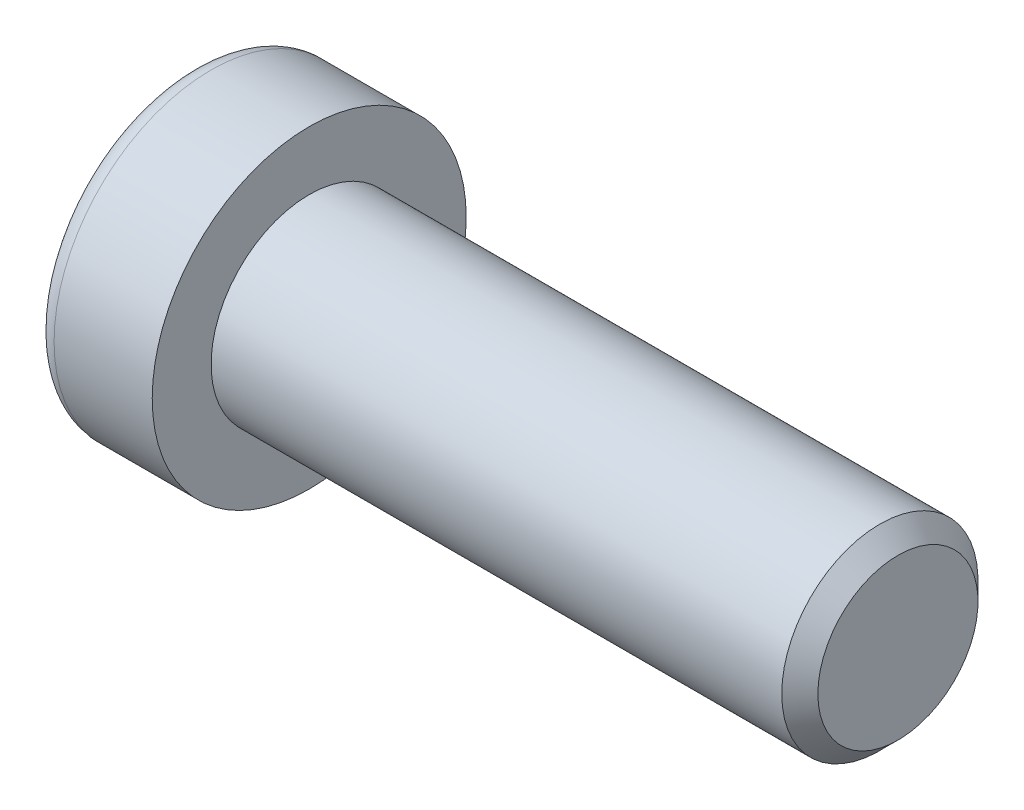
ISO-10303-21;
HEADER;
FILE_DESCRIPTION(('STEP AP214'),'2;1');
FILE_NAME('part.step','',(''),(''),'','','');
FILE_SCHEMA(('AUTOMOTIVE_DESIGN { 1 0 10303 214 1 1 1 1 }'));
ENDSEC;
DATA;
#1=APPLICATION_CONTEXT('core data for automotive mechanical design processes');
#2=APPLICATION_PROTOCOL_DEFINITION('international standard','automotive_design',2000,#1);
#3=PRODUCT_CONTEXT('',#1,'mechanical');
#4=PRODUCT('Part','Part','',(#3));
#5=PRODUCT_RELATED_PRODUCT_CATEGORY('part','',(#4));
#6=PRODUCT_DEFINITION_FORMATION('','',#4);
#7=PRODUCT_DEFINITION_CONTEXT('part definition',#1,'design');
#8=PRODUCT_DEFINITION('design','',#6,#7);
#9=PRODUCT_DEFINITION_SHAPE('','',#8);
#10=(LENGTH_UNIT() NAMED_UNIT(*) SI_UNIT(.MILLI.,.METRE.));
#11=(NAMED_UNIT(*) PLANE_ANGLE_UNIT() SI_UNIT($,.RADIAN.));
#12=(NAMED_UNIT(*) SI_UNIT($,.STERADIAN.) SOLID_ANGLE_UNIT());
#13=UNCERTAINTY_MEASURE_WITH_UNIT(LENGTH_MEASURE(1.E-05),#10,'distance_accuracy_value','');
#14=(GEOMETRIC_REPRESENTATION_CONTEXT(3) GLOBAL_UNCERTAINTY_ASSIGNED_CONTEXT((#13)) GLOBAL_UNIT_ASSIGNED_CONTEXT((#10,
#11,#12)) REPRESENTATION_CONTEXT('',''));
#15=CARTESIAN_POINT('',(0.,0.,0.));
#16=DIRECTION('',(0.,0.,1.));
#17=DIRECTION('',(1.,0.,0.));
#18=AXIS2_PLACEMENT_3D('',#15,#16,#17);
#19=CARTESIAN_POINT('',(-1.51400000237345,0.,0.));
#20=DIRECTION('',(-1.,0.,0.));
#21=DIRECTION('',(0.,0.,1.));
#22=AXIS2_PLACEMENT_3D('',#19,#20,#21);
#23=CONICAL_SURFACE('',#22,4.06570059402611,1.04719754992225);
#24=CARTESIAN_POINT('',(0.833333336629494,-1.70530256582424E-10,0.));
#25=VERTEX_POINT('',#24);
#26=VERTEX_LOOP('',#25);
#27=FACE_BOUND('',#26,.T.);
#28=CARTESIAN_POINT('',(-1.50000000264528,3.50000000060251,2.02072594140006));
#29=CARTESIAN_POINT('',(-1.44871720671821,3.5000000002164,1.84312860694103));
#30=CARTESIAN_POINT('',(-1.40207818764734,3.500000000058,1.66399825484513));
#31=CARTESIAN_POINT('',(-1.3206711805367,3.49999999994187,1.30263602844114));
#32=CARTESIAN_POINT('',(-1.28593198806702,3.49999999998461,1.12039773551564));
#33=CARTESIAN_POINT('',(-1.23185793049781,3.50000000001501,0.758179537473421));
#34=CARTESIAN_POINT('',(-1.21216313061087,3.500000000004,0.578255348658129));
#35=CARTESIAN_POINT('',(-1.18865604653685,3.49999999999601,0.217560809963439));
#36=CARTESIAN_POINT('',(-1.18482429178125,3.499999999999,0.0367917702110673));
#37=CARTESIAN_POINT('',(-1.19281601017606,3.50000000000088,-0.300955787963849));
#38=CARTESIAN_POINT('',(-1.20267725157549,3.50000000000024,-0.457984988160007));
#39=CARTESIAN_POINT('',(-1.23392527879677,3.49999999999977,-0.771020394529853));
#40=CARTESIAN_POINT('',(-1.25532272843638,3.49999999999994,-0.927025518805758));
#41=CARTESIAN_POINT('',(-1.30881221104621,3.50000000000007,-1.24070580763249));
#42=CARTESIAN_POINT('',(-1.34113087664882,3.50000000000004,-1.39834129173674));
#43=CARTESIAN_POINT('',(-1.41448058436693,3.49999999999997,-1.71126180669209));
#44=CARTESIAN_POINT('',(-1.45549440328289,3.49999999999993,-1.86655084332427));
#45=CARTESIAN_POINT('',(-1.50000000303707,3.5,-2.02072594139078));
#46=B_SPLINE_CURVE_WITH_KNOTS('',3,(#28,#29,#30,#31,#32,#33,#34,#35,#36,#37,#38,#39,#40,#41,#42,
#43,#44,#45),.UNSPECIFIED.,.F.,.F.,(4,2,2,2,2,2,2,2,4),(0.,0.554778020331152,1.11088918003109,
1.65323831106675,2.19492155592635,2.66648861952189,3.13849233862163,3.62096283842857,
4.10248645230881),.UNSPECIFIED.);
#47=CARTESIAN_POINT('',(-1.5000000030094,3.49999999962383,2.0207259419465));
#48=VERTEX_POINT('',#47);
#49=CARTESIAN_POINT('',(-1.50000000313479,3.5,-2.02072594172932));
#50=VERTEX_POINT('',#49);
#51=EDGE_CURVE('E20',#48,#50,#46,.T.);
#52=ORIENTED_EDGE('',*,*,#51,.T.);
#53=CARTESIAN_POINT('',(-1.50000000264528,3.49999999963993,-2.0207259430673));
#54=CARTESIAN_POINT('',(-1.44871720671821,3.34619619616096,-2.10952460996242));
#55=CARTESIAN_POINT('',(-1.40207818764734,3.19106476057786,-2.1990897858732));
#56=CARTESIAN_POINT('',(-1.3206711805367,2.87811589248583,-2.37977089897462));
#57=CARTESIAN_POINT('',(-1.28593198806702,2.72029290129141,-2.47089004547439));
#58=CARTESIAN_POINT('',(-1.2318579304978,2.40660274008903,-2.65199914452182));
#59=CARTESIAN_POINT('',(-1.21216313061087,2.25078382181417,-2.74196123891994));
#60=CARTESIAN_POINT('',(-1.18865604653685,1.93841318829426,-2.92230850826035));
#61=CARTESIAN_POINT('',(-1.18482429178125,1.78186260765249,-3.01269302813913));
#62=CARTESIAN_POINT('',(-1.19281601017606,1.48936464220778,-3.18156680722821));
#63=CARTESIAN_POINT('',(-1.20267725157549,1.35337336570164,-3.26008140732574));
#64=CARTESIAN_POINT('',(-1.23392527879676,1.08227675150113,-3.41659911051026));
#65=CARTESIAN_POINT('',(-1.25532272843638,0.947172350757734,-3.49460167264836));
#66=CARTESIAN_POINT('',(-1.30881221104621,0.675517251967411,-3.65144181706184));
#67=CARTESIAN_POINT('',(-1.34113087664882,0.539000918195258,-3.73025955911393));
#68=CARTESIAN_POINT('',(-1.41448058436693,0.26800380287858,-3.88671981659155));
#69=CARTESIAN_POINT('',(-1.45549440328289,0.133519552225884,-3.96436433490761));
#70=CARTESIAN_POINT('',(-1.50000000303707,6.69361529194486E-10,-4.04145188394093));
#71=B_SPLINE_CURVE_WITH_KNOTS('',3,(#53,#54,#55,#56,#57,#58,#59,#60,#61,#62,#63,#64,#65,#66,#67,
#68,#69,#70),.UNSPECIFIED.,.F.,.F.,(4,2,2,2,2,2,2,2,4),(0.,0.554778020331152,1.11088918003109,
1.65323831106675,2.19492155592635,2.66648861952189,3.13849233862163,3.62096283842857,
4.10248645230881),.UNSPECIFIED.);
#72=CARTESIAN_POINT('',(-1.5000000030094,0.,-4.04145188389301));
#73=VERTEX_POINT('',#72);
#74=EDGE_CURVE('E81',#50,#73,#71,.T.);
#75=ORIENTED_EDGE('',*,*,#74,.T.);
#76=CARTESIAN_POINT('',(-1.50000000264528,-9.62577057104049E-10,-4.04145188446735));
#77=CARTESIAN_POINT('',(-1.44871720671821,-0.153803804055437,-3.95265321690346));
#78=CARTESIAN_POINT('',(-1.40207818764734,-0.308935239480137,-3.86308804071833));
#79=CARTESIAN_POINT('',(-1.3206711805367,-0.621884107456032,-3.68240692741576));
#80=CARTESIAN_POINT('',(-1.28593198806702,-0.779707098693197,-3.59128778099003));
#81=CARTESIAN_POINT('',(-1.2318579304978,-1.09339725992598,-3.41017868199525));
#82=CARTESIAN_POINT('',(-1.21216313061087,-1.24921617818983,-3.32021658757807));
#83=CARTESIAN_POINT('',(-1.18865604653685,-1.56158681170174,-3.1398693182238));
#84=CARTESIAN_POINT('',(-1.18482429178125,-1.71813739234651,-3.0494847983502));
#85=CARTESIAN_POINT('',(-1.19281601017606,-2.01063535779309,-2.88061101926437));
#86=CARTESIAN_POINT('',(-1.20267725157549,-2.1466266342986,-2.80209641916574));
#87=CARTESIAN_POINT('',(-1.23392527879676,-2.41772324849863,-2.64557871598041));
#88=CARTESIAN_POINT('',(-1.25532272843638,-2.5528276492422,-2.5675761538426));
#89=CARTESIAN_POINT('',(-1.30881221104621,-2.82448274803266,-2.41073600942935));
#90=CARTESIAN_POINT('',(-1.34113087664882,-2.96099908180478,-2.3319182673772));
#91=CARTESIAN_POINT('',(-1.41448058436693,-3.23199619712139,-2.17545800989946));
#92=CARTESIAN_POINT('',(-1.45549440328289,-3.36648044777405,-2.09781349158334));
#93=CARTESIAN_POINT('',(-1.50000000303707,-3.49999999933064,-2.02072594255015));
#94=B_SPLINE_CURVE_WITH_KNOTS('',3,(#76,#77,#78,#79,#80,#81,#82,#83,#84,#85,#86,#87,#88,#89,#90,
#91,#92,#93),.UNSPECIFIED.,.F.,.F.,(4,2,2,2,2,2,2,2,4),(0.,0.554778020331152,1.11088918003109,
1.65323831106675,2.19492155592635,2.66648861952189,3.13849233862163,3.62096283842857,
4.10248645230881),.UNSPECIFIED.);
#95=CARTESIAN_POINT('',(-1.5000000030094,-3.49999999962383,-2.0207259419465));
#96=VERTEX_POINT('',#95);
#97=EDGE_CURVE('E107',#73,#96,#94,.T.);
#98=ORIENTED_EDGE('',*,*,#97,.T.);
#99=CARTESIAN_POINT('',(-1.50000000264528,-3.50000000060251,-2.02072594140006));
#100=CARTESIAN_POINT('',(-1.44871720671821,-3.50000000021639,-1.84312860694103));
#101=CARTESIAN_POINT('',(-1.40207818764734,-3.500000000058,-1.66399825484514));
#102=CARTESIAN_POINT('',(-1.3206711805367,-3.49999999994186,-1.30263602844114));
#103=CARTESIAN_POINT('',(-1.28593198806702,-3.49999999998461,-1.12039773551565));
#104=CARTESIAN_POINT('',(-1.2318579304978,-3.50000000001501,-0.758179537473426));
#105=CARTESIAN_POINT('',(-1.21216313061087,-3.500000000004,-0.578255348658134));
#106=CARTESIAN_POINT('',(-1.18865604653685,-3.499999999996,-0.217560809963444));
#107=CARTESIAN_POINT('',(-1.18482429178125,-3.499999999999,-0.0367917702110726));
#108=CARTESIAN_POINT('',(-1.19281601017606,-3.50000000000087,0.300955787963844));
#109=CARTESIAN_POINT('',(-1.20267725157549,-3.50000000000024,0.457984988160002));
#110=CARTESIAN_POINT('',(-1.23392527879676,-3.49999999999977,0.771020394529848));
#111=CARTESIAN_POINT('',(-1.25532272843637,-3.49999999999993,0.927025518805754));
#112=CARTESIAN_POINT('',(-1.30881221104621,-3.50000000000007,1.24070580763249));
#113=CARTESIAN_POINT('',(-1.34113087664882,-3.50000000000004,1.39834129173673));
#114=CARTESIAN_POINT('',(-1.41448058436693,-3.49999999999997,1.71126180669209));
#115=CARTESIAN_POINT('',(-1.45549440328289,-3.49999999999993,1.86655084332426));
#116=CARTESIAN_POINT('',(-1.50000000303706,-3.5,2.02072594139078));
#117=B_SPLINE_CURVE_WITH_KNOTS('',3,(#99,#100,#101,#102,#103,#104,#105,#106,#107,#108,#109,#110,
#111,#112,#113,#114,#115,#116),.UNSPECIFIED.,.F.,.F.,(4,2,2,2,2,2,2,2,4),(0.,0.554778020331152,
1.11088918003109,1.65323831106675,2.19492155592635,2.66648861952189,3.13849233862163,
3.62096283842857,4.10248645230881),.UNSPECIFIED.);
#118=CARTESIAN_POINT('',(-1.5000000030094,-3.49999999962383,2.0207259419465));
#119=VERTEX_POINT('',#118);
#120=EDGE_CURVE('E132',#96,#119,#117,.T.);
#121=ORIENTED_EDGE('',*,*,#120,.T.);
#122=CARTESIAN_POINT('',(-1.50000000264528,-3.49999999963993,2.02072594306729));
#123=CARTESIAN_POINT('',(-1.44871720671821,-3.34619619616096,2.10952460996242));
#124=CARTESIAN_POINT('',(-1.40207818764735,-3.19106476057786,2.19908978587319));
#125=CARTESIAN_POINT('',(-1.3206711805367,-2.87811589248583,2.37977089897461));
#126=CARTESIAN_POINT('',(-1.28593198806702,-2.72029290129141,2.47089004547438));
#127=CARTESIAN_POINT('',(-1.2318579304978,-2.40660274008903,2.65199914452182));
#128=CARTESIAN_POINT('',(-1.21216313061087,-2.25078382181417,2.74196123891993));
#129=CARTESIAN_POINT('',(-1.18865604653685,-1.93841318829426,2.92230850826035));
#130=CARTESIAN_POINT('',(-1.18482429178125,-1.78186260765249,3.01269302813913));
#131=CARTESIAN_POINT('',(-1.19281601017606,-1.48936464220779,3.18156680722821));
#132=CARTESIAN_POINT('',(-1.20267725157549,-1.35337336570164,3.26008140732574));
#133=CARTESIAN_POINT('',(-1.23392527879676,-1.08227675150113,3.41659911051026));
#134=CARTESIAN_POINT('',(-1.25532272843637,-0.947172350757735,3.49460167264835));
#135=CARTESIAN_POINT('',(-1.30881221104621,-0.675517251967412,3.65144181706184));
#136=CARTESIAN_POINT('',(-1.34113087664882,-0.539000918195259,3.73025955911393));
#137=CARTESIAN_POINT('',(-1.41448058436693,-0.268003802878581,3.88671981659155));
#138=CARTESIAN_POINT('',(-1.45549440328289,-0.133519552225885,3.96436433490761));
#139=CARTESIAN_POINT('',(-1.50000000303706,-6.693623426515E-10,4.04145188394092));
#140=B_SPLINE_CURVE_WITH_KNOTS('',3,(#122,#123,#124,#125,#126,#127,#128,#129,#130,#131,#132,
#133,#134,#135,#136,#137,#138,#139),.UNSPECIFIED.,.F.,.F.,(4,2,2,2,2,2,2,2,4),(0.,
0.554778020331152,1.11088918003109,1.65323831106675,2.19492155592635,2.66648861952189,
3.13849233862163,3.62096283842857,4.10248645230881),.UNSPECIFIED.);
#141=CARTESIAN_POINT('',(-1.5000000030094,0.,4.04145188389301));
#142=VERTEX_POINT('',#141);
#143=EDGE_CURVE('E141',#119,#142,#140,.T.);
#144=ORIENTED_EDGE('',*,*,#143,.T.);
#145=CARTESIAN_POINT('',(-1.50000000264528,9.62576994072292E-10,4.04145188446735));
#146=CARTESIAN_POINT('',(-1.44871720671821,0.153803804055437,3.95265321690346));
#147=CARTESIAN_POINT('',(-1.40207818764734,0.308935239480137,3.86308804071833));
#148=CARTESIAN_POINT('',(-1.3206711805367,0.621884107456031,3.68240692741576));
#149=CARTESIAN_POINT('',(-1.28593198806702,0.779707098693196,3.59128778099003));
#150=CARTESIAN_POINT('',(-1.2318579304978,1.09339725992598,3.41017868199525));
#151=CARTESIAN_POINT('',(-1.21216313061087,1.24921617818983,3.32021658757807));
#152=CARTESIAN_POINT('',(-1.18865604653685,1.56158681170174,3.1398693182238));
#153=CARTESIAN_POINT('',(-1.18482429178125,1.71813739234651,3.0494847983502));
#154=CARTESIAN_POINT('',(-1.19281601017606,2.01063535779309,2.88061101926437));
#155=CARTESIAN_POINT('',(-1.20267725157549,2.14662663429859,2.80209641916574));
#156=CARTESIAN_POINT('',(-1.23392527879676,2.41772324849863,2.6455787159804));
#157=CARTESIAN_POINT('',(-1.25532272843637,2.5528276492422,2.5675761538426));
#158=CARTESIAN_POINT('',(-1.30881221104621,2.82448274803266,2.41073600942935));
#159=CARTESIAN_POINT('',(-1.34113087664881,2.96099908180478,2.33191826737719));
#160=CARTESIAN_POINT('',(-1.41448058436693,3.23199619712139,2.17545800989946));
#161=CARTESIAN_POINT('',(-1.45549440328289,3.36648044777405,2.09781349158334));
#162=CARTESIAN_POINT('',(-1.50000000303706,3.49999999933064,2.02072594255014));
#163=B_SPLINE_CURVE_WITH_KNOTS('',3,(#145,#146,#147,#148,#149,#150,#151,#152,#153,#154,#155,
#156,#157,#158,#159,#160,#161,#162),.UNSPECIFIED.,.F.,.F.,(4,2,2,2,2,2,2,2,4),(0.,
0.554778020331152,1.11088918003109,1.65323831106675,2.19492155592635,2.66648861952189,
3.13849233862163,3.62096283842857,4.10248645230882),.UNSPECIFIED.);
#164=EDGE_CURVE('E83',#142,#48,#163,.T.);
#165=ORIENTED_EDGE('',*,*,#164,.T.);
#166=EDGE_LOOP('',(#52,#75,#98,#121,#144,#165));
#167=FACE_BOUND('',#166,.T.);
#168=ADVANCED_FACE('F16',(#27,#167),#23,.F.);
#169=CARTESIAN_POINT('',(-6.,3.5,2.02072594216369));
#170=DIRECTION('',(0.,1.,0.));
#171=DIRECTION('',(0.,0.,1.));
#172=AXIS2_PLACEMENT_3D('',#169,#170,#171);
#173=PLANE('',#172);
#174=DIRECTION('',(1.,0.,0.));
#175=VECTOR('',#174,1.);
#176=CARTESIAN_POINT('',(-6.,3.5,2.02072594216368));
#177=LINE('',#176,#175);
#178=CARTESIAN_POINT('',(-6.,3.5,2.02072594216369));
#179=VERTEX_POINT('',#178);
#180=EDGE_CURVE('E85',#48,#179,#177,.F.);
#181=ORIENTED_EDGE('',*,*,#180,.T.);
#182=DIRECTION('',(0.,0.,1.));
#183=VECTOR('',#182,1.);
#184=CARTESIAN_POINT('',(-6.,3.5,0.));
#185=LINE('',#184,#183);
#186=CARTESIAN_POINT('',(-6.,3.5,-2.02072594216369));
#187=VERTEX_POINT('',#186);
#188=EDGE_CURVE('E90',#187,#179,#185,.T.);
#189=ORIENTED_EDGE('',*,*,#188,.F.);
#190=DIRECTION('',(1.,0.,0.));
#191=VECTOR('',#190,1.);
#192=CARTESIAN_POINT('',(-6.,3.5,-2.02072594216369));
#193=LINE('',#192,#191);
#194=EDGE_CURVE('E88',#187,#50,#193,.T.);
#195=ORIENTED_EDGE('',*,*,#194,.T.);
#196=ORIENTED_EDGE('',*,*,#51,.F.);
#197=EDGE_LOOP('',(#181,#189,#195,#196));
#198=FACE_BOUND('',#197,.T.);
#199=ADVANCED_FACE('F77',(#198),#173,.F.);
#200=CARTESIAN_POINT('',(-6.,0.,4.04145188432738));
#201=DIRECTION('',(0.,0.500000000000001,0.866025403784438));
#202=DIRECTION('',(0.,-0.866025403784438,0.500000000000001));
#203=AXIS2_PLACEMENT_3D('',#200,#201,#202);
#204=PLANE('',#203);
#205=DIRECTION('',(1.,0.,0.));
#206=VECTOR('',#205,1.);
#207=CARTESIAN_POINT('',(-6.,0.,4.04145188432738));
#208=LINE('',#207,#206);
#209=CARTESIAN_POINT('',(-6.,0.,4.04145188432738));
#210=VERTEX_POINT('',#209);
#211=EDGE_CURVE('E146',#142,#210,#208,.F.);
#212=ORIENTED_EDGE('',*,*,#211,.T.);
#213=DIRECTION('',(0.,-0.866025403784438,0.500000000000001));
#214=VECTOR('',#213,1.);
#215=CARTESIAN_POINT('',(-6.,3.5,2.02072594216369));
#216=LINE('',#215,#214);
#217=EDGE_CURVE('E96',#179,#210,#216,.T.);
#218=ORIENTED_EDGE('',*,*,#217,.F.);
#219=ORIENTED_EDGE('',*,*,#180,.F.);
#220=ORIENTED_EDGE('',*,*,#164,.F.);
#221=EDGE_LOOP('',(#212,#218,#219,#220));
#222=FACE_BOUND('',#221,.T.);
#223=ADVANCED_FACE('F151',(#222),#204,.F.);
#224=CARTESIAN_POINT('',(-6.,-3.5,2.02072594216369));
#225=DIRECTION('',(0.,-0.5,0.866025403784439));
#226=DIRECTION('',(0.,-0.866025403784439,-0.5));
#227=AXIS2_PLACEMENT_3D('',#224,#225,#226);
#228=PLANE('',#227);
#229=DIRECTION('',(1.,0.,0.));
#230=VECTOR('',#229,1.);
#231=CARTESIAN_POINT('',(-6.,-3.5,2.02072594216369));
#232=LINE('',#231,#230);
#233=CARTESIAN_POINT('',(-6.,-3.5,2.02072594216369));
#234=VERTEX_POINT('',#233);
#235=EDGE_CURVE('E140',#119,#234,#232,.F.);
#236=ORIENTED_EDGE('',*,*,#235,.T.);
#237=DIRECTION('',(0.,-0.866025403784439,-0.5));
#238=VECTOR('',#237,1.);
#239=CARTESIAN_POINT('',(-6.,0.,4.04145188432738));
#240=LINE('',#239,#238);
#241=EDGE_CURVE('E229',#210,#234,#240,.T.);
#242=ORIENTED_EDGE('',*,*,#241,.F.);
#243=ORIENTED_EDGE('',*,*,#211,.F.);
#244=ORIENTED_EDGE('',*,*,#143,.F.);
#245=EDGE_LOOP('',(#236,#242,#243,#244));
#246=FACE_BOUND('',#245,.T.);
#247=ADVANCED_FACE('F128',(#246),#228,.F.);
#248=CARTESIAN_POINT('',(-6.,-3.5,-2.02072594216369));
#249=DIRECTION('',(0.,-1.,0.));
#250=DIRECTION('',(0.,0.,-1.));
#251=AXIS2_PLACEMENT_3D('',#248,#249,#250);
#252=PLANE('',#251);
#253=DIRECTION('',(1.,0.,0.));
#254=VECTOR('',#253,1.);
#255=CARTESIAN_POINT('',(-6.,-3.5,-2.02072594216369));
#256=LINE('',#255,#254);
#257=CARTESIAN_POINT('',(-6.,-3.5,-2.02072594216369));
#258=VERTEX_POINT('',#257);
#259=EDGE_CURVE('E139',#96,#258,#256,.F.);
#260=ORIENTED_EDGE('',*,*,#259,.T.);
#261=DIRECTION('',(0.,0.,1.));
#262=VECTOR('',#261,1.);
#263=CARTESIAN_POINT('',(-6.,-3.5,0.));
#264=LINE('',#263,#262);
#265=EDGE_CURVE('E226',#234,#258,#264,.F.);
#266=ORIENTED_EDGE('',*,*,#265,.F.);
#267=ORIENTED_EDGE('',*,*,#235,.F.);
#268=ORIENTED_EDGE('',*,*,#120,.F.);
#269=EDGE_LOOP('',(#260,#266,#267,#268));
#270=FACE_BOUND('',#269,.T.);
#271=ADVANCED_FACE('F124',(#270),#252,.F.);
#272=CARTESIAN_POINT('',(-6.,0.,-4.04145188432738));
#273=DIRECTION('',(0.,-0.5,-0.866025403784439));
#274=DIRECTION('',(0.,0.866025403784439,-0.5));
#275=AXIS2_PLACEMENT_3D('',#272,#273,#274);
#276=PLANE('',#275);
#277=DIRECTION('',(1.,0.,0.));
#278=VECTOR('',#277,1.);
#279=CARTESIAN_POINT('',(-6.,0.,-4.04145188432738));
#280=LINE('',#279,#278);
#281=CARTESIAN_POINT('',(-6.,0.,-4.04145188432738));
#282=VERTEX_POINT('',#281);
#283=EDGE_CURVE('E39',#73,#282,#280,.F.);
#284=ORIENTED_EDGE('',*,*,#283,.T.);
#285=DIRECTION('',(0.,0.866025403784439,-0.5));
#286=VECTOR('',#285,1.);
#287=CARTESIAN_POINT('',(-6.,-3.5,-2.02072594216369));
#288=LINE('',#287,#286);
#289=EDGE_CURVE('E223',#258,#282,#288,.T.);
#290=ORIENTED_EDGE('',*,*,#289,.F.);
#291=ORIENTED_EDGE('',*,*,#259,.F.);
#292=ORIENTED_EDGE('',*,*,#97,.F.);
#293=EDGE_LOOP('',(#284,#290,#291,#292));
#294=FACE_BOUND('',#293,.T.);
#295=ADVANCED_FACE('F118',(#294),#276,.F.);
#296=CARTESIAN_POINT('',(-6.,3.5,-2.02072594216369));
#297=DIRECTION('',(0.,0.5,-0.866025403784439));
#298=DIRECTION('',(0.,0.866025403784439,0.5));
#299=AXIS2_PLACEMENT_3D('',#296,#297,#298);
#300=PLANE('',#299);
#301=ORIENTED_EDGE('',*,*,#194,.F.);
#302=DIRECTION('',(0.,0.866025403784439,0.5));
#303=VECTOR('',#302,1.);
#304=CARTESIAN_POINT('',(-6.,0.,-4.04145188432738));
#305=LINE('',#304,#303);
#306=EDGE_CURVE('E221',#282,#187,#305,.T.);
#307=ORIENTED_EDGE('',*,*,#306,.F.);
#308=ORIENTED_EDGE('',*,*,#283,.F.);
#309=ORIENTED_EDGE('',*,*,#74,.F.);
#310=EDGE_LOOP('',(#301,#307,#308,#309));
#311=FACE_BOUND('',#310,.T.);
#312=ADVANCED_FACE('F94',(#311),#300,.F.);
#313=CARTESIAN_POINT('',(-6.,6.02072594216369,0.));
#314=DIRECTION('',(-1.,0.,0.));
#315=DIRECTION('',(0.,0.,1.));
#316=AXIS2_PLACEMENT_3D('',#313,#314,#315);
#317=PLANE('',#316);
#318=ORIENTED_EDGE('',*,*,#289,.T.);
#319=ORIENTED_EDGE('',*,*,#306,.T.);
#320=ORIENTED_EDGE('',*,*,#188,.T.);
#321=ORIENTED_EDGE('',*,*,#217,.T.);
#322=ORIENTED_EDGE('',*,*,#241,.T.);
#323=ORIENTED_EDGE('',*,*,#265,.T.);
#324=EDGE_LOOP('',(#318,#319,#320,#321,#322,#323));
#325=FACE_BOUND('',#324,.T.);
#326=CARTESIAN_POINT('',(-6.,0.,0.));
#327=DIRECTION('',(1.,0.,0.));
#328=DIRECTION('',(0.,1.,0.));
#329=AXIS2_PLACEMENT_3D('',#326,#327,#328);
#330=CIRCLE('',#329,7.);
#331=CARTESIAN_POINT('',(-6.,7.,0.));
#332=VERTEX_POINT('',#331);
#333=EDGE_CURVE('E198',#332,#332,#330,.T.);
#334=ORIENTED_EDGE('',*,*,#333,.F.);
#335=EDGE_LOOP('',(#334));
#336=FACE_BOUND('',#335,.T.);
#337=ADVANCED_FACE('F117',(#325,#336),#317,.T.);
#338=CARTESIAN_POINT('',(-5.,0.,0.));
#339=DIRECTION('',(1.,0.,0.));
#340=DIRECTION('',(0.,0.,-1.));
#341=AXIS2_PLACEMENT_3D('',#338,#339,#340);
#342=TOROIDAL_SURFACE('',#341,7.,1.);
#343=CARTESIAN_POINT('',(-5.,0.,0.));
#344=DIRECTION('',(1.,0.,0.));
#345=DIRECTION('',(0.,1.,0.));
#346=AXIS2_PLACEMENT_3D('',#343,#344,#345);
#347=CIRCLE('',#346,8.);
#348=CARTESIAN_POINT('',(-5.,8.,0.));
#349=VERTEX_POINT('',#348);
#350=EDGE_CURVE('E239',#349,#349,#347,.T.);
#351=ORIENTED_EDGE('',*,*,#350,.F.);
#352=EDGE_LOOP('',(#351));
#353=FACE_BOUND('',#352,.T.);
#354=ORIENTED_EDGE('',*,*,#333,.T.);
#355=EDGE_LOOP('',(#354));
#356=FACE_BOUND('',#355,.T.);
#357=ADVANCED_FACE('F182',(#353,#356),#342,.T.);
#358=CARTESIAN_POINT('',(-3.,0.,0.));
#359=DIRECTION('',(1.,0.,0.));
#360=DIRECTION('',(0.,1.,0.));
#361=AXIS2_PLACEMENT_3D('',#358,#359,#360);
#362=CYLINDRICAL_SURFACE('',#361,8.);
#363=ORIENTED_EDGE('',*,*,#350,.T.);
#364=EDGE_LOOP('',(#363));
#365=FACE_BOUND('',#364,.T.);
#366=CARTESIAN_POINT('',(0.,0.,0.));
#367=DIRECTION('',(1.,0.,0.));
#368=DIRECTION('',(0.,1.,0.));
#369=AXIS2_PLACEMENT_3D('',#366,#367,#368);
#370=CIRCLE('',#369,8.);
#371=CARTESIAN_POINT('',(0.,8.,0.));
#372=VERTEX_POINT('',#371);
#373=EDGE_CURVE('E105',#372,#372,#370,.T.);
#374=ORIENTED_EDGE('',*,*,#373,.F.);
#375=EDGE_LOOP('',(#374));
#376=FACE_BOUND('',#375,.T.);
#377=ADVANCED_FACE('F179',(#365,#376),#362,.T.);
#378=CARTESIAN_POINT('',(30.,2.5,0.));
#379=DIRECTION('',(1.,0.,0.));
#380=DIRECTION('',(0.,0.,-1.));
#381=AXIS2_PLACEMENT_3D('',#378,#379,#380);
#382=PLANE('',#381);
#383=CARTESIAN_POINT('',(30.0000000004275,0.,0.));
#384=DIRECTION('',(-1.,0.,0.));
#385=DIRECTION('',(0.,0.,1.));
#386=AXIS2_PLACEMENT_3D('',#383,#384,#385);
#387=CIRCLE('',#386,4.07982500041726);
#388=CARTESIAN_POINT('',(30.0000000004275,0.,4.07982500041726));
#389=VERTEX_POINT('',#388);
#390=EDGE_CURVE('E235',#389,#389,#387,.T.);
#391=ORIENTED_EDGE('',*,*,#390,.F.);
#392=EDGE_LOOP('',(#391));
#393=FACE_BOUND('',#392,.T.);
#394=ADVANCED_FACE('F175',(#393),#382,.T.);
#395=CARTESIAN_POINT('',(0.,6.5,0.));
#396=DIRECTION('',(1.,0.,0.));
#397=DIRECTION('',(0.,0.,-1.));
#398=AXIS2_PLACEMENT_3D('',#395,#396,#397);
#399=PLANE('',#398);
#400=CARTESIAN_POINT('',(0.,0.,0.));
#401=DIRECTION('',(1.,0.,0.));
#402=DIRECTION('',(0.,1.,0.));
#403=AXIS2_PLACEMENT_3D('',#400,#401,#402);
#404=CIRCLE('',#403,5.);
#405=CARTESIAN_POINT('',(0.,5.,0.));
#406=VERTEX_POINT('',#405);
#407=EDGE_CURVE('E30',#406,#406,#404,.T.);
#408=ORIENTED_EDGE('',*,*,#407,.F.);
#409=EDGE_LOOP('',(#408));
#410=FACE_BOUND('',#409,.T.);
#411=ORIENTED_EDGE('',*,*,#373,.T.);
#412=EDGE_LOOP('',(#411));
#413=FACE_BOUND('',#412,.T.);
#414=ADVANCED_FACE('F168',(#410,#413),#399,.T.);
#415=CARTESIAN_POINT('',(29.0798249995987,0.,0.));
#416=DIRECTION('',(-1.,0.,0.));
#417=DIRECTION('',(0.,0.,1.));
#418=AXIS2_PLACEMENT_3D('',#415,#416,#417);
#419=CONICAL_SURFACE('',#418,4.99999999959755,0.785398162501717);
#420=ORIENTED_EDGE('',*,*,#390,.T.);
#421=EDGE_LOOP('',(#420));
#422=FACE_BOUND('',#421,.T.);
#423=CARTESIAN_POINT('',(29.079825,0.,0.));
#424=DIRECTION('',(1.,0.,0.));
#425=DIRECTION('',(0.,1.,0.));
#426=AXIS2_PLACEMENT_3D('',#423,#424,#425);
#427=CIRCLE('',#426,5.);
#428=CARTESIAN_POINT('',(29.079825,5.,0.));
#429=VERTEX_POINT('',#428);
#430=EDGE_CURVE('E11',#429,#429,#427,.F.);
#431=ORIENTED_EDGE('',*,*,#430,.F.);
#432=EDGE_LOOP('',(#431));
#433=FACE_BOUND('',#432,.T.);
#434=ADVANCED_FACE('F162',(#422,#433),#419,.T.);
#435=CARTESIAN_POINT('',(17.25,0.,0.));
#436=DIRECTION('',(1.,0.,0.));
#437=DIRECTION('',(0.,1.,0.));
#438=AXIS2_PLACEMENT_3D('',#435,#436,#437);
#439=CYLINDRICAL_SURFACE('',#438,5.);
#440=ORIENTED_EDGE('',*,*,#430,.T.);
#441=EDGE_LOOP('',(#440));
#442=FACE_BOUND('',#441,.T.);
#443=ORIENTED_EDGE('',*,*,#407,.T.);
#444=EDGE_LOOP('',(#443));
#445=FACE_BOUND('',#444,.T.);
#446=ADVANCED_FACE('F160',(#442,#445),#439,.T.);
#447=CLOSED_SHELL('',(#168,#199,#223,#247,#271,#295,#312,#337,#357,#377,#394,#414,#434,#446));
#448=MANIFOLD_SOLID_BREP('B1',#447);
#449=ADVANCED_BREP_SHAPE_REPRESENTATION('',(#18,#448),#14);
#450=SHAPE_DEFINITION_REPRESENTATION(#9,#449);
ENDSEC;
END-ISO-10303-21;
